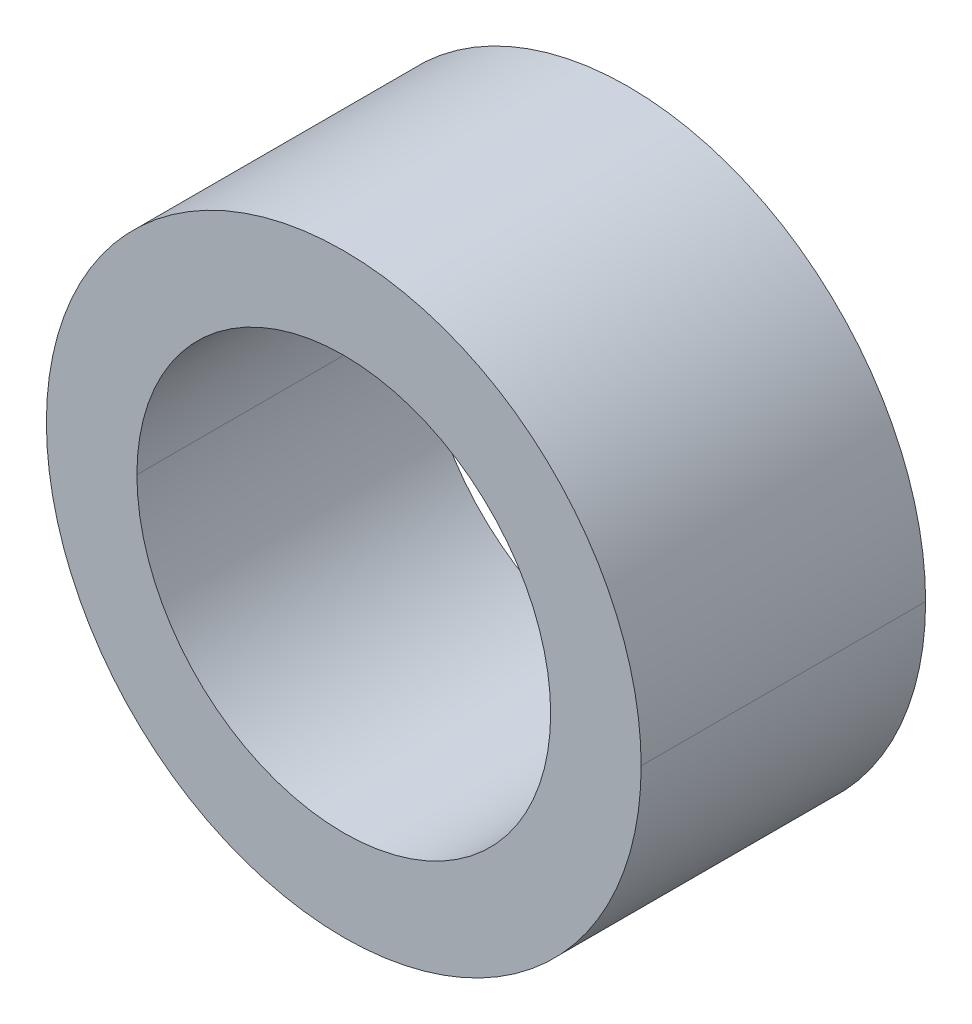
ISO-10303-21;
HEADER;
FILE_DESCRIPTION(('STEP AP214'),'2;1');
FILE_NAME('part.step','',(''),(''),'','','');
FILE_SCHEMA(('AUTOMOTIVE_DESIGN { 1 0 10303 214 1 1 1 1 }'));
ENDSEC;
DATA;
#1=APPLICATION_CONTEXT('core data for automotive mechanical design processes');
#2=APPLICATION_PROTOCOL_DEFINITION('international standard','automotive_design',2000,#1);
#3=PRODUCT_CONTEXT('',#1,'mechanical');
#4=PRODUCT('Part','Part','',(#3));
#5=PRODUCT_RELATED_PRODUCT_CATEGORY('part','',(#4));
#6=PRODUCT_DEFINITION_FORMATION('','',#4);
#7=PRODUCT_DEFINITION_CONTEXT('part definition',#1,'design');
#8=PRODUCT_DEFINITION('design','',#6,#7);
#9=PRODUCT_DEFINITION_SHAPE('','',#8);
#10=(LENGTH_UNIT() NAMED_UNIT(*) SI_UNIT(.MILLI.,.METRE.));
#11=(NAMED_UNIT(*) PLANE_ANGLE_UNIT() SI_UNIT($,.RADIAN.));
#12=(NAMED_UNIT(*) SI_UNIT($,.STERADIAN.) SOLID_ANGLE_UNIT());
#13=UNCERTAINTY_MEASURE_WITH_UNIT(LENGTH_MEASURE(1.E-05),#10,'distance_accuracy_value','');
#14=(GEOMETRIC_REPRESENTATION_CONTEXT(3) GLOBAL_UNCERTAINTY_ASSIGNED_CONTEXT((#13)) GLOBAL_UNIT_ASSIGNED_CONTEXT((#10,
#11,#12)) REPRESENTATION_CONTEXT('',''));
#15=CARTESIAN_POINT('',(0.,0.,0.));
#16=DIRECTION('',(0.,0.,1.));
#17=DIRECTION('',(1.,0.,0.));
#18=AXIS2_PLACEMENT_3D('',#15,#16,#17);
#19=CARTESIAN_POINT('',(0.,0.,-50.));
#20=DIRECTION('',(0.,0.,-1.));
#21=DIRECTION('',(0.,1.,0.));
#22=AXIS2_PLACEMENT_3D('',#19,#20,#21);
#23=CYLINDRICAL_SURFACE('',#22,5.75);
#24=DIRECTION('',(0.,0.,-1.));
#25=VECTOR('',#24,1.);
#26=CARTESIAN_POINT('',(5.75,0.,0.));
#27=LINE('',#26,#25);
#28=CARTESIAN_POINT('',(5.75,0.,0.));
#29=VERTEX_POINT('',#28);
#30=CARTESIAN_POINT('',(5.75,0.,-5.5));
#31=VERTEX_POINT('',#30);
#32=EDGE_CURVE('E11',#29,#31,#27,.T.);
#33=ORIENTED_EDGE('',*,*,#32,.F.);
#34=CARTESIAN_POINT('',(0.,0.,0.));
#35=DIRECTION('',(0.,0.,-1.));
#36=DIRECTION('',(-1.,0.,0.));
#37=AXIS2_PLACEMENT_3D('',#34,#35,#36);
#38=CIRCLE('',#37,5.75);
#39=CARTESIAN_POINT('',(-5.75,0.,0.));
#40=VERTEX_POINT('',#39);
#41=EDGE_CURVE('E25',#29,#40,#38,.T.);
#42=ORIENTED_EDGE('',*,*,#41,.T.);
#43=DIRECTION('',(0.,0.,-1.));
#44=VECTOR('',#43,1.);
#45=CARTESIAN_POINT('',(-5.75,0.,0.));
#46=LINE('',#45,#44);
#47=CARTESIAN_POINT('',(-5.75,0.,-5.5));
#48=VERTEX_POINT('',#47);
#49=EDGE_CURVE('E103',#40,#48,#46,.T.);
#50=ORIENTED_EDGE('',*,*,#49,.T.);
#51=CARTESIAN_POINT('',(0.,0.,-5.5));
#52=DIRECTION('',(0.,0.,-1.));
#53=DIRECTION('',(-1.,0.,0.));
#54=AXIS2_PLACEMENT_3D('',#51,#52,#53);
#55=CIRCLE('',#54,5.75);
#56=EDGE_CURVE('E98',#31,#48,#55,.T.);
#57=ORIENTED_EDGE('',*,*,#56,.F.);
#58=EDGE_LOOP('',(#33,#42,#50,#57));
#59=FACE_BOUND('',#58,.T.);
#60=ADVANCED_FACE('F17',(#59),#23,.T.);
#61=CARTESIAN_POINT('',(0.,4.,-5.5));
#62=DIRECTION('',(0.,0.,-1.));
#63=DIRECTION('',(-1.,0.,0.));
#64=AXIS2_PLACEMENT_3D('',#61,#62,#63);
#65=PLANE('',#64);
#66=CARTESIAN_POINT('',(0.,0.,-5.5));
#67=DIRECTION('',(0.,0.,-1.));
#68=DIRECTION('',(-1.,0.,0.));
#69=AXIS2_PLACEMENT_3D('',#66,#67,#68);
#70=CIRCLE('',#69,5.75);
#71=EDGE_CURVE('E93',#48,#31,#70,.T.);
#72=ORIENTED_EDGE('',*,*,#71,.T.);
#73=ORIENTED_EDGE('',*,*,#56,.T.);
#74=EDGE_LOOP('',(#72,#73));
#75=FACE_BOUND('',#74,.T.);
#76=CARTESIAN_POINT('',(0.,0.,-5.5));
#77=DIRECTION('',(0.,0.,-1.));
#78=DIRECTION('',(-1.,0.,0.));
#79=AXIS2_PLACEMENT_3D('',#76,#77,#78);
#80=CIRCLE('',#79,4.);
#81=CARTESIAN_POINT('',(4.,0.,-5.5));
#82=VERTEX_POINT('',#81);
#83=CARTESIAN_POINT('',(-4.,0.,-5.5));
#84=VERTEX_POINT('',#83);
#85=EDGE_CURVE('E69',#82,#84,#80,.T.);
#86=ORIENTED_EDGE('',*,*,#85,.F.);
#87=CARTESIAN_POINT('',(0.,0.,-5.5));
#88=DIRECTION('',(0.,0.,-1.));
#89=DIRECTION('',(-1.,0.,0.));
#90=AXIS2_PLACEMENT_3D('',#87,#88,#89);
#91=CIRCLE('',#90,4.);
#92=EDGE_CURVE('E86',#84,#82,#91,.T.);
#93=ORIENTED_EDGE('',*,*,#92,.F.);
#94=EDGE_LOOP('',(#86,#93));
#95=FACE_BOUND('',#94,.T.);
#96=ADVANCED_FACE('F116',(#75,#95),#65,.T.);
#97=CARTESIAN_POINT('',(0.,0.,-50.));
#98=DIRECTION('',(0.,0.,-1.));
#99=DIRECTION('',(0.,-1.,0.));
#100=AXIS2_PLACEMENT_3D('',#97,#98,#99);
#101=CYLINDRICAL_SURFACE('',#100,4.);
#102=DIRECTION('',(0.,0.,-1.));
#103=VECTOR('',#102,1.);
#104=CARTESIAN_POINT('',(4.,0.,0.));
#105=LINE('',#104,#103);
#106=CARTESIAN_POINT('',(4.,0.,0.));
#107=VERTEX_POINT('',#106);
#108=EDGE_CURVE('E61',#107,#82,#105,.T.);
#109=ORIENTED_EDGE('',*,*,#108,.F.);
#110=CARTESIAN_POINT('',(0.,0.,0.));
#111=DIRECTION('',(0.,0.,-1.));
#112=DIRECTION('',(-1.,0.,0.));
#113=AXIS2_PLACEMENT_3D('',#110,#111,#112);
#114=CIRCLE('',#113,4.);
#115=CARTESIAN_POINT('',(-4.,0.,0.));
#116=VERTEX_POINT('',#115);
#117=EDGE_CURVE('E54',#116,#107,#114,.T.);
#118=ORIENTED_EDGE('',*,*,#117,.F.);
#119=DIRECTION('',(0.,0.,-1.));
#120=VECTOR('',#119,1.);
#121=CARTESIAN_POINT('',(-4.,0.,0.));
#122=LINE('',#121,#120);
#123=EDGE_CURVE('E58',#116,#84,#122,.T.);
#124=ORIENTED_EDGE('',*,*,#123,.T.);
#125=ORIENTED_EDGE('',*,*,#92,.T.);
#126=EDGE_LOOP('',(#109,#118,#124,#125));
#127=FACE_BOUND('',#126,.T.);
#128=ADVANCED_FACE('F56',(#127),#101,.F.);
#129=CARTESIAN_POINT('',(0.,0.,-50.));
#130=DIRECTION('',(0.,0.,-1.));
#131=DIRECTION('',(0.,1.,0.));
#132=AXIS2_PLACEMENT_3D('',#129,#130,#131);
#133=CYLINDRICAL_SURFACE('',#132,4.);
#134=ORIENTED_EDGE('',*,*,#108,.T.);
#135=ORIENTED_EDGE('',*,*,#85,.T.);
#136=ORIENTED_EDGE('',*,*,#123,.F.);
#137=CARTESIAN_POINT('',(0.,0.,0.));
#138=DIRECTION('',(0.,0.,-1.));
#139=DIRECTION('',(-1.,0.,0.));
#140=AXIS2_PLACEMENT_3D('',#137,#138,#139);
#141=CIRCLE('',#140,4.);
#142=EDGE_CURVE('E68',#107,#116,#141,.T.);
#143=ORIENTED_EDGE('',*,*,#142,.F.);
#144=EDGE_LOOP('',(#134,#135,#136,#143));
#145=FACE_BOUND('',#144,.T.);
#146=ADVANCED_FACE('F67',(#145),#133,.F.);
#147=CARTESIAN_POINT('',(0.,5.75,0.));
#148=DIRECTION('',(0.,0.,1.));
#149=DIRECTION('',(1.,0.,0.));
#150=AXIS2_PLACEMENT_3D('',#147,#148,#149);
#151=PLANE('',#150);
#152=ORIENTED_EDGE('',*,*,#117,.T.);
#153=ORIENTED_EDGE('',*,*,#142,.T.);
#154=EDGE_LOOP('',(#152,#153));
#155=FACE_BOUND('',#154,.T.);
#156=ORIENTED_EDGE('',*,*,#41,.F.);
#157=CARTESIAN_POINT('',(0.,0.,0.));
#158=DIRECTION('',(0.,0.,-1.));
#159=DIRECTION('',(-1.,0.,0.));
#160=AXIS2_PLACEMENT_3D('',#157,#158,#159);
#161=CIRCLE('',#160,5.75);
#162=EDGE_CURVE('E73',#40,#29,#161,.T.);
#163=ORIENTED_EDGE('',*,*,#162,.F.);
#164=EDGE_LOOP('',(#156,#163));
#165=FACE_BOUND('',#164,.T.);
#166=ADVANCED_FACE('F71',(#155,#165),#151,.T.);
#167=CARTESIAN_POINT('',(0.,0.,-50.));
#168=DIRECTION('',(0.,0.,-1.));
#169=DIRECTION('',(0.,-1.,0.));
#170=AXIS2_PLACEMENT_3D('',#167,#168,#169);
#171=CYLINDRICAL_SURFACE('',#170,5.75);
#172=ORIENTED_EDGE('',*,*,#32,.T.);
#173=ORIENTED_EDGE('',*,*,#71,.F.);
#174=ORIENTED_EDGE('',*,*,#49,.F.);
#175=ORIENTED_EDGE('',*,*,#162,.T.);
#176=EDGE_LOOP('',(#172,#173,#174,#175));
#177=FACE_BOUND('',#176,.T.);
#178=ADVANCED_FACE('F114',(#177),#171,.T.);
#179=CLOSED_SHELL('',(#60,#96,#128,#146,#166,#178));
#180=MANIFOLD_SOLID_BREP('B1',#179);
#181=ADVANCED_BREP_SHAPE_REPRESENTATION('',(#18,#180),#14);
#182=SHAPE_DEFINITION_REPRESENTATION(#9,#181);
ENDSEC;
END-ISO-10303-21;
